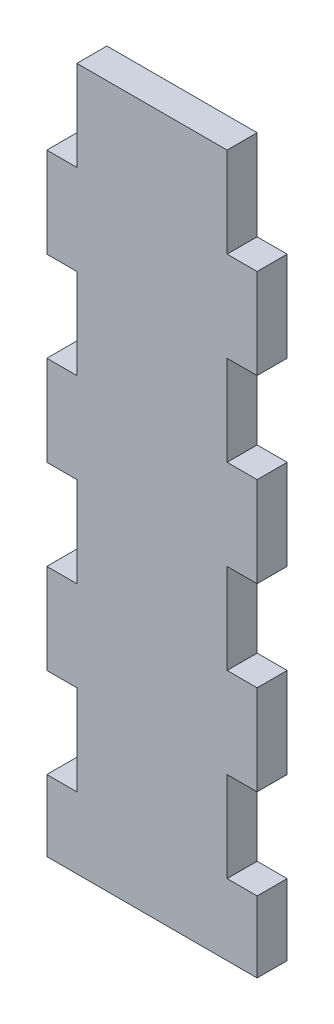
ISO-10303-21;
HEADER;
FILE_DESCRIPTION(('STEP AP214'),'2;1');
FILE_NAME('part.step','',(''),(''),'','','');
FILE_SCHEMA(('AUTOMOTIVE_DESIGN { 1 0 10303 214 1 1 1 1 }'));
ENDSEC;
DATA;
#1=APPLICATION_CONTEXT('core data for automotive mechanical design processes');
#2=APPLICATION_PROTOCOL_DEFINITION('international standard','automotive_design',2000,#1);
#3=PRODUCT_CONTEXT('',#1,'mechanical');
#4=PRODUCT('Part','Part','',(#3));
#5=PRODUCT_RELATED_PRODUCT_CATEGORY('part','',(#4));
#6=PRODUCT_DEFINITION_FORMATION('','',#4);
#7=PRODUCT_DEFINITION_CONTEXT('part definition',#1,'design');
#8=PRODUCT_DEFINITION('design','',#6,#7);
#9=PRODUCT_DEFINITION_SHAPE('','',#8);
#10=(LENGTH_UNIT() NAMED_UNIT(*) SI_UNIT(.MILLI.,.METRE.));
#11=(NAMED_UNIT(*) PLANE_ANGLE_UNIT() SI_UNIT($,.RADIAN.));
#12=(NAMED_UNIT(*) SI_UNIT($,.STERADIAN.) SOLID_ANGLE_UNIT());
#13=UNCERTAINTY_MEASURE_WITH_UNIT(LENGTH_MEASURE(1.E-05),#10,'distance_accuracy_value','');
#14=(GEOMETRIC_REPRESENTATION_CONTEXT(3) GLOBAL_UNCERTAINTY_ASSIGNED_CONTEXT((#13)) GLOBAL_UNIT_ASSIGNED_CONTEXT((#10,
#11,#12)) REPRESENTATION_CONTEXT('',''));
#15=CARTESIAN_POINT('',(0.,0.,0.));
#16=DIRECTION('',(0.,0.,1.));
#17=DIRECTION('',(1.,0.,0.));
#18=AXIS2_PLACEMENT_3D('',#15,#16,#17);
#19=CARTESIAN_POINT('',(22.8840904006907,110.021741477256,6.));
#20=DIRECTION('',(0.,-1.,0.));
#21=DIRECTION('',(0.,0.,-1.));
#22=AXIS2_PLACEMENT_3D('',#19,#20,#21);
#23=PLANE('',#22);
#24=DIRECTION('',(-1.,0.,0.));
#25=VECTOR('',#24,1.);
#26=CARTESIAN_POINT('',(22.8840904006907,110.021741477256,0.));
#27=LINE('',#26,#25);
#28=CARTESIAN_POINT('',(22.8840904006907,110.021741477256,0.));
#29=VERTEX_POINT('',#28);
#30=CARTESIAN_POINT('',(16.8840904006907,110.021741477256,0.));
#31=VERTEX_POINT('',#30);
#32=EDGE_CURVE('E284',#29,#31,#27,.T.);
#33=ORIENTED_EDGE('',*,*,#32,.F.);
#34=DIRECTION('',(0.,0.,-1.));
#35=VECTOR('',#34,1.);
#36=CARTESIAN_POINT('',(22.8840904006907,110.021741477256,6.));
#37=LINE('',#36,#35);
#38=CARTESIAN_POINT('',(22.8840904006907,110.021741477256,6.));
#39=VERTEX_POINT('',#38);
#40=EDGE_CURVE('E11',#39,#29,#37,.T.);
#41=ORIENTED_EDGE('',*,*,#40,.F.);
#42=DIRECTION('',(-1.,0.,0.));
#43=VECTOR('',#42,1.);
#44=CARTESIAN_POINT('',(22.8840904006907,110.021741477256,6.));
#45=LINE('',#44,#43);
#46=CARTESIAN_POINT('',(16.8840904006907,110.021741477256,6.));
#47=VERTEX_POINT('',#46);
#48=EDGE_CURVE('E398',#39,#47,#45,.T.);
#49=ORIENTED_EDGE('',*,*,#48,.T.);
#50=DIRECTION('',(0.,0.,-1.));
#51=VECTOR('',#50,1.);
#52=CARTESIAN_POINT('',(16.8840904006907,110.021741477256,6.));
#53=LINE('',#52,#51);
#54=EDGE_CURVE('E42',#47,#31,#53,.T.);
#55=ORIENTED_EDGE('',*,*,#54,.T.);
#56=EDGE_LOOP('',(#33,#41,#49,#55));
#57=FACE_BOUND('',#56,.T.);
#58=ADVANCED_FACE('F39',(#57),#23,.T.);
#59=CARTESIAN_POINT('',(22.8840904006907,110.021741477256,6.));
#60=DIRECTION('',(1.,0.,0.));
#61=DIRECTION('',(0.,0.,-1.));
#62=AXIS2_PLACEMENT_3D('',#59,#60,#61);
#63=PLANE('',#62);
#64=DIRECTION('',(0.,-1.,0.));
#65=VECTOR('',#64,1.);
#66=CARTESIAN_POINT('',(22.8840904006907,110.021741477256,0.));
#67=LINE('',#66,#65);
#68=CARTESIAN_POINT('',(22.8840904006907,92.0217414772559,0.));
#69=VERTEX_POINT('',#68);
#70=EDGE_CURVE('E396',#29,#69,#67,.T.);
#71=ORIENTED_EDGE('',*,*,#70,.T.);
#72=DIRECTION('',(0.,0.,-1.));
#73=VECTOR('',#72,1.);
#74=CARTESIAN_POINT('',(22.8840904006907,92.0217414772559,6.));
#75=LINE('',#74,#73);
#76=CARTESIAN_POINT('',(22.8840904006907,92.0217414772559,6.));
#77=VERTEX_POINT('',#76);
#78=EDGE_CURVE('E49',#77,#69,#75,.T.);
#79=ORIENTED_EDGE('',*,*,#78,.F.);
#80=DIRECTION('',(0.,-1.,0.));
#81=VECTOR('',#80,1.);
#82=CARTESIAN_POINT('',(22.8840904006907,110.021741477256,6.));
#83=LINE('',#82,#81);
#84=EDGE_CURVE('E277',#39,#77,#83,.T.);
#85=ORIENTED_EDGE('',*,*,#84,.F.);
#86=ORIENTED_EDGE('',*,*,#40,.T.);
#87=EDGE_LOOP('',(#71,#79,#85,#86));
#88=FACE_BOUND('',#87,.T.);
#89=ADVANCED_FACE('F499',(#88),#63,.F.);
#90=CARTESIAN_POINT('',(16.8840904006907,92.0217414772559,6.));
#91=DIRECTION('',(0.,1.,0.));
#92=DIRECTION('',(0.,0.,1.));
#93=AXIS2_PLACEMENT_3D('',#90,#91,#92);
#94=PLANE('',#93);
#95=DIRECTION('',(1.,0.,0.));
#96=VECTOR('',#95,1.);
#97=CARTESIAN_POINT('',(16.8840904006907,92.0217414772559,0.));
#98=LINE('',#97,#96);
#99=CARTESIAN_POINT('',(16.8840904006907,92.0217414772559,0.));
#100=VERTEX_POINT('',#99);
#101=EDGE_CURVE('E261',#100,#69,#98,.T.);
#102=ORIENTED_EDGE('',*,*,#101,.F.);
#103=DIRECTION('',(0.,0.,-1.));
#104=VECTOR('',#103,1.);
#105=CARTESIAN_POINT('',(16.8840904006907,92.0217414772559,6.));
#106=LINE('',#105,#104);
#107=CARTESIAN_POINT('',(16.8840904006907,92.0217414772559,6.));
#108=VERTEX_POINT('',#107);
#109=EDGE_CURVE('E255',#108,#100,#106,.T.);
#110=ORIENTED_EDGE('',*,*,#109,.F.);
#111=DIRECTION('',(1.,0.,0.));
#112=VECTOR('',#111,1.);
#113=CARTESIAN_POINT('',(16.8840904006907,92.0217414772559,6.));
#114=LINE('',#113,#112);
#115=EDGE_CURVE('E259',#108,#77,#114,.T.);
#116=ORIENTED_EDGE('',*,*,#115,.T.);
#117=ORIENTED_EDGE('',*,*,#78,.T.);
#118=EDGE_LOOP('',(#102,#110,#116,#117));
#119=FACE_BOUND('',#118,.T.);
#120=ADVANCED_FACE('F257',(#119),#94,.T.);
#121=CARTESIAN_POINT('',(16.8840904006907,92.0217414772559,6.));
#122=DIRECTION('',(1.,0.,0.));
#123=DIRECTION('',(0.,0.,-1.));
#124=AXIS2_PLACEMENT_3D('',#121,#122,#123);
#125=PLANE('',#124);
#126=DIRECTION('',(0.,-1.,0.));
#127=VECTOR('',#126,1.);
#128=CARTESIAN_POINT('',(16.8840904006907,92.0217414772559,0.));
#129=LINE('',#128,#127);
#130=CARTESIAN_POINT('',(16.8840904006907,74.0217414772559,0.));
#131=VERTEX_POINT('',#130);
#132=EDGE_CURVE('E391',#100,#131,#129,.T.);
#133=ORIENTED_EDGE('',*,*,#132,.T.);
#134=DIRECTION('',(0.,0.,-1.));
#135=VECTOR('',#134,1.);
#136=CARTESIAN_POINT('',(16.8840904006907,74.0217414772559,6.));
#137=LINE('',#136,#135);
#138=CARTESIAN_POINT('',(16.8840904006907,74.0217414772559,6.));
#139=VERTEX_POINT('',#138);
#140=EDGE_CURVE('E266',#139,#131,#137,.T.);
#141=ORIENTED_EDGE('',*,*,#140,.F.);
#142=DIRECTION('',(0.,-1.,0.));
#143=VECTOR('',#142,1.);
#144=CARTESIAN_POINT('',(16.8840904006907,92.0217414772559,6.));
#145=LINE('',#144,#143);
#146=EDGE_CURVE('E269',#108,#139,#145,.T.);
#147=ORIENTED_EDGE('',*,*,#146,.F.);
#148=ORIENTED_EDGE('',*,*,#109,.T.);
#149=EDGE_LOOP('',(#133,#141,#147,#148));
#150=FACE_BOUND('',#149,.T.);
#151=ADVANCED_FACE('F270',(#150),#125,.F.);
#152=CARTESIAN_POINT('',(22.8840904006907,74.0217414772559,6.));
#153=DIRECTION('',(0.,-1.,0.));
#154=DIRECTION('',(0.,0.,-1.));
#155=AXIS2_PLACEMENT_3D('',#152,#153,#154);
#156=PLANE('',#155);
#157=DIRECTION('',(-1.,0.,0.));
#158=VECTOR('',#157,1.);
#159=CARTESIAN_POINT('',(22.8840904006907,74.0217414772559,0.));
#160=LINE('',#159,#158);
#161=CARTESIAN_POINT('',(22.8840904006907,74.0217414772559,0.));
#162=VERTEX_POINT('',#161);
#163=EDGE_CURVE('E387',#162,#131,#160,.T.);
#164=ORIENTED_EDGE('',*,*,#163,.F.);
#165=DIRECTION('',(0.,0.,-1.));
#166=VECTOR('',#165,1.);
#167=CARTESIAN_POINT('',(22.8840904006907,74.0217414772559,6.));
#168=LINE('',#167,#166);
#169=CARTESIAN_POINT('',(22.8840904006907,74.0217414772559,6.));
#170=VERTEX_POINT('',#169);
#171=EDGE_CURVE('E404',#170,#162,#168,.T.);
#172=ORIENTED_EDGE('',*,*,#171,.F.);
#173=DIRECTION('',(-1.,0.,0.));
#174=VECTOR('',#173,1.);
#175=CARTESIAN_POINT('',(22.8840904006907,74.0217414772559,6.));
#176=LINE('',#175,#174);
#177=EDGE_CURVE('E274',#170,#139,#176,.T.);
#178=ORIENTED_EDGE('',*,*,#177,.T.);
#179=ORIENTED_EDGE('',*,*,#140,.T.);
#180=EDGE_LOOP('',(#164,#172,#178,#179));
#181=FACE_BOUND('',#180,.T.);
#182=ADVANCED_FACE('F594',(#181),#156,.T.);
#183=CARTESIAN_POINT('',(22.8840904006907,74.0217414772559,6.));
#184=DIRECTION('',(1.,0.,0.));
#185=DIRECTION('',(0.,0.,-1.));
#186=AXIS2_PLACEMENT_3D('',#183,#184,#185);
#187=PLANE('',#186);
#188=DIRECTION('',(0.,-1.,0.));
#189=VECTOR('',#188,1.);
#190=CARTESIAN_POINT('',(22.8840904006907,74.0217414772559,0.));
#191=LINE('',#190,#189);
#192=CARTESIAN_POINT('',(22.8840904006907,56.0217414772559,0.));
#193=VERTEX_POINT('',#192);
#194=EDGE_CURVE('E383',#162,#193,#191,.T.);
#195=ORIENTED_EDGE('',*,*,#194,.T.);
#196=DIRECTION('',(0.,0.,-1.));
#197=VECTOR('',#196,1.);
#198=CARTESIAN_POINT('',(22.8840904006907,56.0217414772559,6.));
#199=LINE('',#198,#197);
#200=CARTESIAN_POINT('',(22.8840904006907,56.0217414772559,6.));
#201=VERTEX_POINT('',#200);
#202=EDGE_CURVE('E407',#201,#193,#199,.T.);
#203=ORIENTED_EDGE('',*,*,#202,.F.);
#204=DIRECTION('',(0.,-1.,0.));
#205=VECTOR('',#204,1.);
#206=CARTESIAN_POINT('',(22.8840904006907,74.0217414772559,6.));
#207=LINE('',#206,#205);
#208=EDGE_CURVE('E589',#170,#201,#207,.T.);
#209=ORIENTED_EDGE('',*,*,#208,.F.);
#210=ORIENTED_EDGE('',*,*,#171,.T.);
#211=EDGE_LOOP('',(#195,#203,#209,#210));
#212=FACE_BOUND('',#211,.T.);
#213=ADVANCED_FACE('F599',(#212),#187,.F.);
#214=CARTESIAN_POINT('',(16.8840904006907,56.0217414772559,6.));
#215=DIRECTION('',(0.,1.,0.));
#216=DIRECTION('',(0.,0.,1.));
#217=AXIS2_PLACEMENT_3D('',#214,#215,#216);
#218=PLANE('',#217);
#219=DIRECTION('',(1.,0.,0.));
#220=VECTOR('',#219,1.);
#221=CARTESIAN_POINT('',(16.8840904006907,56.0217414772559,0.));
#222=LINE('',#221,#220);
#223=CARTESIAN_POINT('',(16.8840904006907,56.0217414772559,0.));
#224=VERTEX_POINT('',#223);
#225=EDGE_CURVE('E379',#224,#193,#222,.T.);
#226=ORIENTED_EDGE('',*,*,#225,.F.);
#227=DIRECTION('',(0.,0.,-1.));
#228=VECTOR('',#227,1.);
#229=CARTESIAN_POINT('',(16.8840904006907,56.0217414772559,6.));
#230=LINE('',#229,#228);
#231=CARTESIAN_POINT('',(16.8840904006907,56.0217414772559,6.));
#232=VERTEX_POINT('',#231);
#233=EDGE_CURVE('E410',#232,#224,#230,.T.);
#234=ORIENTED_EDGE('',*,*,#233,.F.);
#235=DIRECTION('',(1.,0.,0.));
#236=VECTOR('',#235,1.);
#237=CARTESIAN_POINT('',(16.8840904006907,56.0217414772559,6.));
#238=LINE('',#237,#236);
#239=EDGE_CURVE('E585',#232,#201,#238,.T.);
#240=ORIENTED_EDGE('',*,*,#239,.T.);
#241=ORIENTED_EDGE('',*,*,#202,.T.);
#242=EDGE_LOOP('',(#226,#234,#240,#241));
#243=FACE_BOUND('',#242,.T.);
#244=ADVANCED_FACE('F603',(#243),#218,.T.);
#245=CARTESIAN_POINT('',(16.8840904006907,56.0217414772559,6.));
#246=DIRECTION('',(1.,0.,0.));
#247=DIRECTION('',(0.,0.,-1.));
#248=AXIS2_PLACEMENT_3D('',#245,#246,#247);
#249=PLANE('',#248);
#250=DIRECTION('',(0.,-1.,0.));
#251=VECTOR('',#250,1.);
#252=CARTESIAN_POINT('',(16.8840904006907,56.0217414772559,0.));
#253=LINE('',#252,#251);
#254=CARTESIAN_POINT('',(16.8840904006907,38.0217414772559,0.));
#255=VERTEX_POINT('',#254);
#256=EDGE_CURVE('E375',#224,#255,#253,.T.);
#257=ORIENTED_EDGE('',*,*,#256,.T.);
#258=DIRECTION('',(0.,0.,-1.));
#259=VECTOR('',#258,1.);
#260=CARTESIAN_POINT('',(16.8840904006907,38.0217414772559,6.));
#261=LINE('',#260,#259);
#262=CARTESIAN_POINT('',(16.8840904006907,38.0217414772559,6.));
#263=VERTEX_POINT('',#262);
#264=EDGE_CURVE('E413',#263,#255,#261,.T.);
#265=ORIENTED_EDGE('',*,*,#264,.F.);
#266=DIRECTION('',(0.,-1.,0.));
#267=VECTOR('',#266,1.);
#268=CARTESIAN_POINT('',(16.8840904006907,56.0217414772559,6.));
#269=LINE('',#268,#267);
#270=EDGE_CURVE('E582',#232,#263,#269,.T.);
#271=ORIENTED_EDGE('',*,*,#270,.F.);
#272=ORIENTED_EDGE('',*,*,#233,.T.);
#273=EDGE_LOOP('',(#257,#265,#271,#272));
#274=FACE_BOUND('',#273,.T.);
#275=ADVANCED_FACE('F608',(#274),#249,.F.);
#276=CARTESIAN_POINT('',(22.8840904006907,38.0217414772559,6.));
#277=DIRECTION('',(0.,-1.,0.));
#278=DIRECTION('',(0.,0.,-1.));
#279=AXIS2_PLACEMENT_3D('',#276,#277,#278);
#280=PLANE('',#279);
#281=DIRECTION('',(-1.,0.,0.));
#282=VECTOR('',#281,1.);
#283=CARTESIAN_POINT('',(22.8840904006907,38.0217414772559,0.));
#284=LINE('',#283,#282);
#285=CARTESIAN_POINT('',(22.8840904006907,38.0217414772559,0.));
#286=VERTEX_POINT('',#285);
#287=EDGE_CURVE('E371',#286,#255,#284,.T.);
#288=ORIENTED_EDGE('',*,*,#287,.F.);
#289=DIRECTION('',(0.,0.,-1.));
#290=VECTOR('',#289,1.);
#291=CARTESIAN_POINT('',(22.8840904006907,38.0217414772559,6.));
#292=LINE('',#291,#290);
#293=CARTESIAN_POINT('',(22.8840904006907,38.0217414772559,6.));
#294=VERTEX_POINT('',#293);
#295=EDGE_CURVE('E416',#294,#286,#292,.T.);
#296=ORIENTED_EDGE('',*,*,#295,.F.);
#297=DIRECTION('',(-1.,0.,0.));
#298=VECTOR('',#297,1.);
#299=CARTESIAN_POINT('',(22.8840904006907,38.0217414772559,6.));
#300=LINE('',#299,#298);
#301=EDGE_CURVE('E578',#294,#263,#300,.T.);
#302=ORIENTED_EDGE('',*,*,#301,.T.);
#303=ORIENTED_EDGE('',*,*,#264,.T.);
#304=EDGE_LOOP('',(#288,#296,#302,#303));
#305=FACE_BOUND('',#304,.T.);
#306=ADVANCED_FACE('F614',(#305),#280,.T.);
#307=CARTESIAN_POINT('',(22.8840904006907,38.0217414772559,6.));
#308=DIRECTION('',(1.,0.,0.));
#309=DIRECTION('',(0.,0.,-1.));
#310=AXIS2_PLACEMENT_3D('',#307,#308,#309);
#311=PLANE('',#310);
#312=DIRECTION('',(0.,-1.,0.));
#313=VECTOR('',#312,1.);
#314=CARTESIAN_POINT('',(22.8840904006907,38.0217414772559,0.));
#315=LINE('',#314,#313);
#316=CARTESIAN_POINT('',(22.8840904006907,20.0217414772559,0.));
#317=VERTEX_POINT('',#316);
#318=EDGE_CURVE('E368',#286,#317,#315,.T.);
#319=ORIENTED_EDGE('',*,*,#318,.T.);
#320=DIRECTION('',(0.,0.,-1.));
#321=VECTOR('',#320,1.);
#322=CARTESIAN_POINT('',(22.8840904006907,20.0217414772559,6.));
#323=LINE('',#322,#321);
#324=CARTESIAN_POINT('',(22.8840904006907,20.0217414772559,6.));
#325=VERTEX_POINT('',#324);
#326=EDGE_CURVE('E419',#325,#317,#323,.T.);
#327=ORIENTED_EDGE('',*,*,#326,.F.);
#328=DIRECTION('',(0.,-1.,0.));
#329=VECTOR('',#328,1.);
#330=CARTESIAN_POINT('',(22.8840904006907,38.0217414772559,6.));
#331=LINE('',#330,#329);
#332=EDGE_CURVE('E575',#294,#325,#331,.T.);
#333=ORIENTED_EDGE('',*,*,#332,.F.);
#334=ORIENTED_EDGE('',*,*,#295,.T.);
#335=EDGE_LOOP('',(#319,#327,#333,#334));
#336=FACE_BOUND('',#335,.T.);
#337=ADVANCED_FACE('F617',(#336),#311,.F.);
#338=CARTESIAN_POINT('',(22.8840904006907,20.0217414772559,6.));
#339=DIRECTION('',(0.,-1.,0.));
#340=DIRECTION('',(0.,0.,-1.));
#341=AXIS2_PLACEMENT_3D('',#338,#339,#340);
#342=PLANE('',#341);
#343=DIRECTION('',(-1.,0.,0.));
#344=VECTOR('',#343,1.);
#345=CARTESIAN_POINT('',(22.8840904006907,20.0217414772559,0.));
#346=LINE('',#345,#344);
#347=CARTESIAN_POINT('',(16.8840904006907,20.0217414772559,0.));
#348=VERTEX_POINT('',#347);
#349=EDGE_CURVE('E365',#317,#348,#346,.T.);
#350=ORIENTED_EDGE('',*,*,#349,.T.);
#351=DIRECTION('',(0.,0.,-1.));
#352=VECTOR('',#351,1.);
#353=CARTESIAN_POINT('',(16.8840904006907,20.0217414772559,6.));
#354=LINE('',#353,#352);
#355=CARTESIAN_POINT('',(16.8840904006907,20.0217414772559,6.));
#356=VERTEX_POINT('',#355);
#357=EDGE_CURVE('E423',#356,#348,#354,.T.);
#358=ORIENTED_EDGE('',*,*,#357,.F.);
#359=DIRECTION('',(-1.,0.,0.));
#360=VECTOR('',#359,1.);
#361=CARTESIAN_POINT('',(22.8840904006907,20.0217414772559,6.));
#362=LINE('',#361,#360);
#363=EDGE_CURVE('E572',#325,#356,#362,.T.);
#364=ORIENTED_EDGE('',*,*,#363,.F.);
#365=ORIENTED_EDGE('',*,*,#326,.T.);
#366=EDGE_LOOP('',(#350,#358,#364,#365));
#367=FACE_BOUND('',#366,.T.);
#368=ADVANCED_FACE('F622',(#367),#342,.F.);
#369=CARTESIAN_POINT('',(16.8840904006907,20.0217414772559,6.));
#370=DIRECTION('',(1.,0.,0.));
#371=DIRECTION('',(0.,1.,0.));
#372=AXIS2_PLACEMENT_3D('',#369,#370,#371);
#373=PLANE('',#372);
#374=DIRECTION('',(0.,-1.,0.));
#375=VECTOR('',#374,1.);
#376=CARTESIAN_POINT('',(16.8840904006907,20.0217414772559,0.));
#377=LINE('',#376,#375);
#378=CARTESIAN_POINT('',(16.8840904006912,5.82936261258773,0.));
#379=VERTEX_POINT('',#378);
#380=EDGE_CURVE('E362',#348,#379,#377,.T.);
#381=ORIENTED_EDGE('',*,*,#380,.T.);
#382=DIRECTION('',(0.,0.,-1.));
#383=VECTOR('',#382,1.);
#384=CARTESIAN_POINT('',(16.8840904006912,5.82936261258773,6.));
#385=LINE('',#384,#383);
#386=CARTESIAN_POINT('',(16.8840904006912,5.82936261258773,6.));
#387=VERTEX_POINT('',#386);
#388=EDGE_CURVE('E427',#387,#379,#385,.T.);
#389=ORIENTED_EDGE('',*,*,#388,.F.);
#390=DIRECTION('',(0.,-1.,0.));
#391=VECTOR('',#390,1.);
#392=CARTESIAN_POINT('',(16.8840904006907,20.0217414772559,6.));
#393=LINE('',#392,#391);
#394=EDGE_CURVE('E569',#356,#387,#393,.T.);
#395=ORIENTED_EDGE('',*,*,#394,.F.);
#396=ORIENTED_EDGE('',*,*,#357,.T.);
#397=EDGE_LOOP('',(#381,#389,#395,#396));
#398=FACE_BOUND('',#397,.T.);
#399=ADVANCED_FACE('F629',(#398),#373,.F.);
#400=CARTESIAN_POINT('',(16.8840904006912,5.82936261258773,6.));
#401=DIRECTION('',(0.,1.,0.));
#402=DIRECTION('',(0.,0.,1.));
#403=AXIS2_PLACEMENT_3D('',#400,#401,#402);
#404=PLANE('',#403);
#405=DIRECTION('',(1.,0.,0.));
#406=VECTOR('',#405,1.);
#407=CARTESIAN_POINT('',(16.8840904006912,5.82936261258773,0.));
#408=LINE('',#407,#406);
#409=CARTESIAN_POINT('',(58.8840904006907,5.82936261258773,0.));
#410=VERTEX_POINT('',#409);
#411=EDGE_CURVE('E358',#379,#410,#408,.T.);
#412=ORIENTED_EDGE('',*,*,#411,.T.);
#413=DIRECTION('',(0.,0.,-1.));
#414=VECTOR('',#413,1.);
#415=CARTESIAN_POINT('',(58.8840904006907,5.82936261258773,6.));
#416=LINE('',#415,#414);
#417=CARTESIAN_POINT('',(58.8840904006907,5.82936261258773,6.));
#418=VERTEX_POINT('',#417);
#419=EDGE_CURVE('E431',#418,#410,#416,.T.);
#420=ORIENTED_EDGE('',*,*,#419,.F.);
#421=DIRECTION('',(1.,0.,0.));
#422=VECTOR('',#421,1.);
#423=CARTESIAN_POINT('',(16.8840904006912,5.82936261258773,6.));
#424=LINE('',#423,#422);
#425=EDGE_CURVE('E566',#387,#418,#424,.T.);
#426=ORIENTED_EDGE('',*,*,#425,.F.);
#427=ORIENTED_EDGE('',*,*,#388,.T.);
#428=EDGE_LOOP('',(#412,#420,#426,#427));
#429=FACE_BOUND('',#428,.T.);
#430=ADVANCED_FACE('F633',(#429),#404,.F.);
#431=CARTESIAN_POINT('',(58.8840904006907,20.0217414772559,6.));
#432=DIRECTION('',(1.,0.,0.));
#433=DIRECTION('',(0.,0.,-1.));
#434=AXIS2_PLACEMENT_3D('',#431,#432,#433);
#435=PLANE('',#434);
#436=DIRECTION('',(0.,-1.,0.));
#437=VECTOR('',#436,1.);
#438=CARTESIAN_POINT('',(58.8840904006907,20.0217414772559,0.));
#439=LINE('',#438,#437);
#440=CARTESIAN_POINT('',(58.8840904006907,20.0217414772559,0.));
#441=VERTEX_POINT('',#440);
#442=EDGE_CURVE('E354',#441,#410,#439,.T.);
#443=ORIENTED_EDGE('',*,*,#442,.F.);
#444=DIRECTION('',(0.,0.,-1.));
#445=VECTOR('',#444,1.);
#446=CARTESIAN_POINT('',(58.8840904006907,20.0217414772559,6.));
#447=LINE('',#446,#445);
#448=CARTESIAN_POINT('',(58.8840904006907,20.0217414772559,6.));
#449=VERTEX_POINT('',#448);
#450=EDGE_CURVE('E434',#449,#441,#447,.T.);
#451=ORIENTED_EDGE('',*,*,#450,.F.);
#452=DIRECTION('',(0.,-1.,0.));
#453=VECTOR('',#452,1.);
#454=CARTESIAN_POINT('',(58.8840904006907,20.0217414772559,6.));
#455=LINE('',#454,#453);
#456=EDGE_CURVE('E562',#449,#418,#455,.T.);
#457=ORIENTED_EDGE('',*,*,#456,.T.);
#458=ORIENTED_EDGE('',*,*,#419,.T.);
#459=EDGE_LOOP('',(#443,#451,#457,#458));
#460=FACE_BOUND('',#459,.T.);
#461=ADVANCED_FACE('F636',(#460),#435,.T.);
#462=CARTESIAN_POINT('',(52.8840904006907,20.0217414772559,6.));
#463=DIRECTION('',(0.,1.,0.));
#464=DIRECTION('',(0.,0.,1.));
#465=AXIS2_PLACEMENT_3D('',#462,#463,#464);
#466=PLANE('',#465);
#467=DIRECTION('',(1.,0.,0.));
#468=VECTOR('',#467,1.);
#469=CARTESIAN_POINT('',(52.8840904006907,20.0217414772559,0.));
#470=LINE('',#469,#468);
#471=CARTESIAN_POINT('',(52.8840904006907,20.0217414772559,0.));
#472=VERTEX_POINT('',#471);
#473=EDGE_CURVE('E350',#472,#441,#470,.T.);
#474=ORIENTED_EDGE('',*,*,#473,.F.);
#475=DIRECTION('',(0.,0.,-1.));
#476=VECTOR('',#475,1.);
#477=CARTESIAN_POINT('',(52.8840904006907,20.0217414772559,6.));
#478=LINE('',#477,#476);
#479=CARTESIAN_POINT('',(52.8840904006907,20.0217414772559,6.));
#480=VERTEX_POINT('',#479);
#481=EDGE_CURVE('E437',#480,#472,#478,.T.);
#482=ORIENTED_EDGE('',*,*,#481,.F.);
#483=DIRECTION('',(1.,0.,0.));
#484=VECTOR('',#483,1.);
#485=CARTESIAN_POINT('',(52.8840904006907,20.0217414772559,6.));
#486=LINE('',#485,#484);
#487=EDGE_CURVE('E558',#480,#449,#486,.T.);
#488=ORIENTED_EDGE('',*,*,#487,.T.);
#489=ORIENTED_EDGE('',*,*,#450,.T.);
#490=EDGE_LOOP('',(#474,#482,#488,#489));
#491=FACE_BOUND('',#490,.T.);
#492=ADVANCED_FACE('F640',(#491),#466,.T.);
#493=CARTESIAN_POINT('',(52.8840904006907,20.0217414772559,6.));
#494=DIRECTION('',(-1.,0.,0.));
#495=DIRECTION('',(0.,0.,1.));
#496=AXIS2_PLACEMENT_3D('',#493,#494,#495);
#497=PLANE('',#496);
#498=DIRECTION('',(0.,1.,0.));
#499=VECTOR('',#498,1.);
#500=CARTESIAN_POINT('',(52.8840904006907,20.0217414772559,0.));
#501=LINE('',#500,#499);
#502=CARTESIAN_POINT('',(52.8840904006907,38.0217414772559,0.));
#503=VERTEX_POINT('',#502);
#504=EDGE_CURVE('E347',#472,#503,#501,.T.);
#505=ORIENTED_EDGE('',*,*,#504,.T.);
#506=DIRECTION('',(0.,0.,-1.));
#507=VECTOR('',#506,1.);
#508=CARTESIAN_POINT('',(52.8840904006907,38.0217414772559,6.));
#509=LINE('',#508,#507);
#510=CARTESIAN_POINT('',(52.8840904006907,38.0217414772559,6.));
#511=VERTEX_POINT('',#510);
#512=EDGE_CURVE('E440',#511,#503,#509,.T.);
#513=ORIENTED_EDGE('',*,*,#512,.F.);
#514=DIRECTION('',(0.,1.,0.));
#515=VECTOR('',#514,1.);
#516=CARTESIAN_POINT('',(52.8840904006907,20.0217414772559,6.));
#517=LINE('',#516,#515);
#518=EDGE_CURVE('E555',#480,#511,#517,.T.);
#519=ORIENTED_EDGE('',*,*,#518,.F.);
#520=ORIENTED_EDGE('',*,*,#481,.T.);
#521=EDGE_LOOP('',(#505,#513,#519,#520));
#522=FACE_BOUND('',#521,.T.);
#523=ADVANCED_FACE('F645',(#522),#497,.F.);
#524=CARTESIAN_POINT('',(52.8840904006907,38.0217414772559,6.));
#525=DIRECTION('',(0.,1.,0.));
#526=DIRECTION('',(0.,0.,1.));
#527=AXIS2_PLACEMENT_3D('',#524,#525,#526);
#528=PLANE('',#527);
#529=DIRECTION('',(1.,0.,0.));
#530=VECTOR('',#529,1.);
#531=CARTESIAN_POINT('',(52.8840904006907,38.0217414772559,0.));
#532=LINE('',#531,#530);
#533=CARTESIAN_POINT('',(58.8840904006907,38.0217414772559,0.));
#534=VERTEX_POINT('',#533);
#535=EDGE_CURVE('E343',#503,#534,#532,.T.);
#536=ORIENTED_EDGE('',*,*,#535,.T.);
#537=DIRECTION('',(0.,0.,-1.));
#538=VECTOR('',#537,1.);
#539=CARTESIAN_POINT('',(58.8840904006907,38.0217414772559,6.));
#540=LINE('',#539,#538);
#541=CARTESIAN_POINT('',(58.8840904006907,38.0217414772559,6.));
#542=VERTEX_POINT('',#541);
#543=EDGE_CURVE('E444',#542,#534,#540,.T.);
#544=ORIENTED_EDGE('',*,*,#543,.F.);
#545=DIRECTION('',(1.,0.,0.));
#546=VECTOR('',#545,1.);
#547=CARTESIAN_POINT('',(52.8840904006907,38.0217414772559,6.));
#548=LINE('',#547,#546);
#549=EDGE_CURVE('E552',#511,#542,#548,.T.);
#550=ORIENTED_EDGE('',*,*,#549,.F.);
#551=ORIENTED_EDGE('',*,*,#512,.T.);
#552=EDGE_LOOP('',(#536,#544,#550,#551));
#553=FACE_BOUND('',#552,.T.);
#554=ADVANCED_FACE('F650',(#553),#528,.F.);
#555=CARTESIAN_POINT('',(58.8840904006907,56.0217414772559,6.));
#556=DIRECTION('',(1.,0.,0.));
#557=DIRECTION('',(0.,0.,-1.));
#558=AXIS2_PLACEMENT_3D('',#555,#556,#557);
#559=PLANE('',#558);
#560=DIRECTION('',(0.,-1.,0.));
#561=VECTOR('',#560,1.);
#562=CARTESIAN_POINT('',(58.8840904006907,56.0217414772559,0.));
#563=LINE('',#562,#561);
#564=CARTESIAN_POINT('',(58.8840904006907,56.0217414772559,0.));
#565=VERTEX_POINT('',#564);
#566=EDGE_CURVE('E339',#565,#534,#563,.T.);
#567=ORIENTED_EDGE('',*,*,#566,.F.);
#568=DIRECTION('',(0.,0.,-1.));
#569=VECTOR('',#568,1.);
#570=CARTESIAN_POINT('',(58.8840904006907,56.0217414772559,6.));
#571=LINE('',#570,#569);
#572=CARTESIAN_POINT('',(58.8840904006907,56.0217414772559,6.));
#573=VERTEX_POINT('',#572);
#574=EDGE_CURVE('E447',#573,#565,#571,.T.);
#575=ORIENTED_EDGE('',*,*,#574,.F.);
#576=DIRECTION('',(0.,-1.,0.));
#577=VECTOR('',#576,1.);
#578=CARTESIAN_POINT('',(58.8840904006907,56.0217414772559,6.));
#579=LINE('',#578,#577);
#580=EDGE_CURVE('E548',#573,#542,#579,.T.);
#581=ORIENTED_EDGE('',*,*,#580,.T.);
#582=ORIENTED_EDGE('',*,*,#543,.T.);
#583=EDGE_LOOP('',(#567,#575,#581,#582));
#584=FACE_BOUND('',#583,.T.);
#585=ADVANCED_FACE('F654',(#584),#559,.T.);
#586=CARTESIAN_POINT('',(58.8840904006907,56.0217414772559,6.));
#587=DIRECTION('',(0.,-1.,0.));
#588=DIRECTION('',(0.,0.,-1.));
#589=AXIS2_PLACEMENT_3D('',#586,#587,#588);
#590=PLANE('',#589);
#591=DIRECTION('',(-1.,0.,0.));
#592=VECTOR('',#591,1.);
#593=CARTESIAN_POINT('',(58.8840904006907,56.0217414772559,0.));
#594=LINE('',#593,#592);
#595=CARTESIAN_POINT('',(52.8840904006907,56.0217414772559,0.));
#596=VERTEX_POINT('',#595);
#597=EDGE_CURVE('E336',#565,#596,#594,.T.);
#598=ORIENTED_EDGE('',*,*,#597,.T.);
#599=DIRECTION('',(0.,0.,-1.));
#600=VECTOR('',#599,1.);
#601=CARTESIAN_POINT('',(52.8840904006907,56.0217414772559,6.));
#602=LINE('',#601,#600);
#603=CARTESIAN_POINT('',(52.8840904006907,56.0217414772559,6.));
#604=VERTEX_POINT('',#603);
#605=EDGE_CURVE('E450',#604,#596,#602,.T.);
#606=ORIENTED_EDGE('',*,*,#605,.F.);
#607=DIRECTION('',(-1.,0.,0.));
#608=VECTOR('',#607,1.);
#609=CARTESIAN_POINT('',(58.8840904006907,56.0217414772559,6.));
#610=LINE('',#609,#608);
#611=EDGE_CURVE('E545',#573,#604,#610,.T.);
#612=ORIENTED_EDGE('',*,*,#611,.F.);
#613=ORIENTED_EDGE('',*,*,#574,.T.);
#614=EDGE_LOOP('',(#598,#606,#612,#613));
#615=FACE_BOUND('',#614,.T.);
#616=ADVANCED_FACE('F659',(#615),#590,.F.);
#617=CARTESIAN_POINT('',(52.8840904006907,56.0217414772559,6.));
#618=DIRECTION('',(-1.,0.,0.));
#619=DIRECTION('',(0.,0.,1.));
#620=AXIS2_PLACEMENT_3D('',#617,#618,#619);
#621=PLANE('',#620);
#622=DIRECTION('',(0.,1.,0.));
#623=VECTOR('',#622,1.);
#624=CARTESIAN_POINT('',(52.8840904006907,56.0217414772559,0.));
#625=LINE('',#624,#623);
#626=CARTESIAN_POINT('',(52.8840904006907,74.0217414772559,0.));
#627=VERTEX_POINT('',#626);
#628=EDGE_CURVE('E333',#596,#627,#625,.T.);
#629=ORIENTED_EDGE('',*,*,#628,.T.);
#630=DIRECTION('',(0.,0.,-1.));
#631=VECTOR('',#630,1.);
#632=CARTESIAN_POINT('',(52.8840904006907,74.0217414772559,6.));
#633=LINE('',#632,#631);
#634=CARTESIAN_POINT('',(52.8840904006907,74.0217414772559,6.));
#635=VERTEX_POINT('',#634);
#636=EDGE_CURVE('E454',#635,#627,#633,.T.);
#637=ORIENTED_EDGE('',*,*,#636,.F.);
#638=DIRECTION('',(0.,1.,0.));
#639=VECTOR('',#638,1.);
#640=CARTESIAN_POINT('',(52.8840904006907,56.0217414772559,6.));
#641=LINE('',#640,#639);
#642=EDGE_CURVE('E542',#604,#635,#641,.T.);
#643=ORIENTED_EDGE('',*,*,#642,.F.);
#644=ORIENTED_EDGE('',*,*,#605,.T.);
#645=EDGE_LOOP('',(#629,#637,#643,#644));
#646=FACE_BOUND('',#645,.T.);
#647=ADVANCED_FACE('F666',(#646),#621,.F.);
#648=CARTESIAN_POINT('',(52.8840904006907,74.0217414772559,6.));
#649=DIRECTION('',(0.,1.,0.));
#650=DIRECTION('',(0.,0.,1.));
#651=AXIS2_PLACEMENT_3D('',#648,#649,#650);
#652=PLANE('',#651);
#653=DIRECTION('',(1.,0.,0.));
#654=VECTOR('',#653,1.);
#655=CARTESIAN_POINT('',(52.8840904006907,74.0217414772559,0.));
#656=LINE('',#655,#654);
#657=CARTESIAN_POINT('',(58.8840904006907,74.0217414772559,0.));
#658=VERTEX_POINT('',#657);
#659=EDGE_CURVE('E329',#627,#658,#656,.T.);
#660=ORIENTED_EDGE('',*,*,#659,.T.);
#661=DIRECTION('',(0.,0.,-1.));
#662=VECTOR('',#661,1.);
#663=CARTESIAN_POINT('',(58.8840904006907,74.0217414772559,6.));
#664=LINE('',#663,#662);
#665=CARTESIAN_POINT('',(58.8840904006907,74.0217414772559,6.));
#666=VERTEX_POINT('',#665);
#667=EDGE_CURVE('E458',#666,#658,#664,.T.);
#668=ORIENTED_EDGE('',*,*,#667,.F.);
#669=DIRECTION('',(1.,0.,0.));
#670=VECTOR('',#669,1.);
#671=CARTESIAN_POINT('',(52.8840904006907,74.0217414772559,6.));
#672=LINE('',#671,#670);
#673=EDGE_CURVE('E539',#635,#666,#672,.T.);
#674=ORIENTED_EDGE('',*,*,#673,.F.);
#675=ORIENTED_EDGE('',*,*,#636,.T.);
#676=EDGE_LOOP('',(#660,#668,#674,#675));
#677=FACE_BOUND('',#676,.T.);
#678=ADVANCED_FACE('F670',(#677),#652,.F.);
#679=CARTESIAN_POINT('',(58.8840904006907,92.0217414772559,6.));
#680=DIRECTION('',(1.,0.,0.));
#681=DIRECTION('',(0.,0.,-1.));
#682=AXIS2_PLACEMENT_3D('',#679,#680,#681);
#683=PLANE('',#682);
#684=DIRECTION('',(0.,-1.,0.));
#685=VECTOR('',#684,1.);
#686=CARTESIAN_POINT('',(58.8840904006907,92.0217414772559,0.));
#687=LINE('',#686,#685);
#688=CARTESIAN_POINT('',(58.8840904006907,92.0217414772559,0.));
#689=VERTEX_POINT('',#688);
#690=EDGE_CURVE('E325',#689,#658,#687,.T.);
#691=ORIENTED_EDGE('',*,*,#690,.F.);
#692=DIRECTION('',(0.,0.,-1.));
#693=VECTOR('',#692,1.);
#694=CARTESIAN_POINT('',(58.8840904006907,92.0217414772559,6.));
#695=LINE('',#694,#693);
#696=CARTESIAN_POINT('',(58.8840904006907,92.0217414772559,6.));
#697=VERTEX_POINT('',#696);
#698=EDGE_CURVE('E461',#697,#689,#695,.T.);
#699=ORIENTED_EDGE('',*,*,#698,.F.);
#700=DIRECTION('',(0.,-1.,0.));
#701=VECTOR('',#700,1.);
#702=CARTESIAN_POINT('',(58.8840904006907,92.0217414772559,6.));
#703=LINE('',#702,#701);
#704=EDGE_CURVE('E535',#697,#666,#703,.T.);
#705=ORIENTED_EDGE('',*,*,#704,.T.);
#706=ORIENTED_EDGE('',*,*,#667,.T.);
#707=EDGE_LOOP('',(#691,#699,#705,#706));
#708=FACE_BOUND('',#707,.T.);
#709=ADVANCED_FACE('F673',(#708),#683,.T.);
#710=CARTESIAN_POINT('',(58.8840904006907,92.0217414772559,6.));
#711=DIRECTION('',(0.,-1.,0.));
#712=DIRECTION('',(0.,0.,-1.));
#713=AXIS2_PLACEMENT_3D('',#710,#711,#712);
#714=PLANE('',#713);
#715=DIRECTION('',(-1.,0.,0.));
#716=VECTOR('',#715,1.);
#717=CARTESIAN_POINT('',(58.8840904006907,92.0217414772559,0.));
#718=LINE('',#717,#716);
#719=CARTESIAN_POINT('',(52.8840904006907,92.0217414772559,0.));
#720=VERTEX_POINT('',#719);
#721=EDGE_CURVE('E322',#689,#720,#718,.T.);
#722=ORIENTED_EDGE('',*,*,#721,.T.);
#723=DIRECTION('',(0.,0.,-1.));
#724=VECTOR('',#723,1.);
#725=CARTESIAN_POINT('',(52.8840904006907,92.0217414772559,6.));
#726=LINE('',#725,#724);
#727=CARTESIAN_POINT('',(52.8840904006907,92.0217414772559,6.));
#728=VERTEX_POINT('',#727);
#729=EDGE_CURVE('E464',#728,#720,#726,.T.);
#730=ORIENTED_EDGE('',*,*,#729,.F.);
#731=DIRECTION('',(-1.,0.,0.));
#732=VECTOR('',#731,1.);
#733=CARTESIAN_POINT('',(58.8840904006907,92.0217414772559,6.));
#734=LINE('',#733,#732);
#735=EDGE_CURVE('E532',#697,#728,#734,.T.);
#736=ORIENTED_EDGE('',*,*,#735,.F.);
#737=ORIENTED_EDGE('',*,*,#698,.T.);
#738=EDGE_LOOP('',(#722,#730,#736,#737));
#739=FACE_BOUND('',#738,.T.);
#740=ADVANCED_FACE('F679',(#739),#714,.F.);
#741=CARTESIAN_POINT('',(52.8840904006907,92.0217414772559,6.));
#742=DIRECTION('',(-1.,0.,0.));
#743=DIRECTION('',(0.,0.,1.));
#744=AXIS2_PLACEMENT_3D('',#741,#742,#743);
#745=PLANE('',#744);
#746=DIRECTION('',(0.,1.,0.));
#747=VECTOR('',#746,1.);
#748=CARTESIAN_POINT('',(52.8840904006907,92.0217414772559,0.));
#749=LINE('',#748,#747);
#750=CARTESIAN_POINT('',(52.8840904006907,110.021741477256,0.));
#751=VERTEX_POINT('',#750);
#752=EDGE_CURVE('E319',#720,#751,#749,.T.);
#753=ORIENTED_EDGE('',*,*,#752,.T.);
#754=DIRECTION('',(0.,0.,-1.));
#755=VECTOR('',#754,1.);
#756=CARTESIAN_POINT('',(52.8840904006907,110.021741477256,6.));
#757=LINE('',#756,#755);
#758=CARTESIAN_POINT('',(52.8840904006907,110.021741477256,6.));
#759=VERTEX_POINT('',#758);
#760=EDGE_CURVE('E468',#759,#751,#757,.T.);
#761=ORIENTED_EDGE('',*,*,#760,.F.);
#762=DIRECTION('',(0.,1.,0.));
#763=VECTOR('',#762,1.);
#764=CARTESIAN_POINT('',(52.8840904006907,92.0217414772559,6.));
#765=LINE('',#764,#763);
#766=EDGE_CURVE('E529',#728,#759,#765,.T.);
#767=ORIENTED_EDGE('',*,*,#766,.F.);
#768=ORIENTED_EDGE('',*,*,#729,.T.);
#769=EDGE_LOOP('',(#753,#761,#767,#768));
#770=FACE_BOUND('',#769,.T.);
#771=ADVANCED_FACE('F683',(#770),#745,.F.);
#772=CARTESIAN_POINT('',(52.8840904006907,110.021741477256,6.));
#773=DIRECTION('',(0.,1.,0.));
#774=DIRECTION('',(0.,0.,1.));
#775=AXIS2_PLACEMENT_3D('',#772,#773,#774);
#776=PLANE('',#775);
#777=DIRECTION('',(1.,0.,0.));
#778=VECTOR('',#777,1.);
#779=CARTESIAN_POINT('',(52.8840904006907,110.021741477256,0.));
#780=LINE('',#779,#778);
#781=CARTESIAN_POINT('',(58.8840904006907,110.021741477256,0.));
#782=VERTEX_POINT('',#781);
#783=EDGE_CURVE('E315',#751,#782,#780,.T.);
#784=ORIENTED_EDGE('',*,*,#783,.T.);
#785=DIRECTION('',(0.,0.,-1.));
#786=VECTOR('',#785,1.);
#787=CARTESIAN_POINT('',(58.8840904006907,110.021741477256,6.));
#788=LINE('',#787,#786);
#789=CARTESIAN_POINT('',(58.8840904006907,110.021741477256,6.));
#790=VERTEX_POINT('',#789);
#791=EDGE_CURVE('E472',#790,#782,#788,.T.);
#792=ORIENTED_EDGE('',*,*,#791,.F.);
#793=DIRECTION('',(1.,0.,0.));
#794=VECTOR('',#793,1.);
#795=CARTESIAN_POINT('',(52.8840904006907,110.021741477256,6.));
#796=LINE('',#795,#794);
#797=EDGE_CURVE('E526',#759,#790,#796,.T.);
#798=ORIENTED_EDGE('',*,*,#797,.F.);
#799=ORIENTED_EDGE('',*,*,#760,.T.);
#800=EDGE_LOOP('',(#784,#792,#798,#799));
#801=FACE_BOUND('',#800,.T.);
#802=ADVANCED_FACE('F688',(#801),#776,.F.);
#803=CARTESIAN_POINT('',(58.8840904006907,128.021741477256,6.));
#804=DIRECTION('',(1.,0.,0.));
#805=DIRECTION('',(0.,0.,-1.));
#806=AXIS2_PLACEMENT_3D('',#803,#804,#805);
#807=PLANE('',#806);
#808=DIRECTION('',(0.,-1.,0.));
#809=VECTOR('',#808,1.);
#810=CARTESIAN_POINT('',(58.8840904006907,128.021741477256,0.));
#811=LINE('',#810,#809);
#812=CARTESIAN_POINT('',(58.8840904006907,128.021741477256,0.));
#813=VERTEX_POINT('',#812);
#814=EDGE_CURVE('E311',#813,#782,#811,.T.);
#815=ORIENTED_EDGE('',*,*,#814,.F.);
#816=DIRECTION('',(0.,0.,-1.));
#817=VECTOR('',#816,1.);
#818=CARTESIAN_POINT('',(58.8840904006907,128.021741477256,6.));
#819=LINE('',#818,#817);
#820=CARTESIAN_POINT('',(58.8840904006907,128.021741477256,6.));
#821=VERTEX_POINT('',#820);
#822=EDGE_CURVE('E475',#821,#813,#819,.T.);
#823=ORIENTED_EDGE('',*,*,#822,.F.);
#824=DIRECTION('',(0.,-1.,0.));
#825=VECTOR('',#824,1.);
#826=CARTESIAN_POINT('',(58.8840904006907,128.021741477256,6.));
#827=LINE('',#826,#825);
#828=EDGE_CURVE('E522',#821,#790,#827,.T.);
#829=ORIENTED_EDGE('',*,*,#828,.T.);
#830=ORIENTED_EDGE('',*,*,#791,.T.);
#831=EDGE_LOOP('',(#815,#823,#829,#830));
#832=FACE_BOUND('',#831,.T.);
#833=ADVANCED_FACE('F694',(#832),#807,.T.);
#834=CARTESIAN_POINT('',(58.8840904006907,128.021741477256,6.));
#835=DIRECTION('',(0.,-1.,0.));
#836=DIRECTION('',(0.,0.,-1.));
#837=AXIS2_PLACEMENT_3D('',#834,#835,#836);
#838=PLANE('',#837);
#839=DIRECTION('',(-1.,0.,0.));
#840=VECTOR('',#839,1.);
#841=CARTESIAN_POINT('',(58.8840904006907,128.021741477256,0.));
#842=LINE('',#841,#840);
#843=CARTESIAN_POINT('',(52.8840904006907,128.021741477256,0.));
#844=VERTEX_POINT('',#843);
#845=EDGE_CURVE('E308',#813,#844,#842,.T.);
#846=ORIENTED_EDGE('',*,*,#845,.T.);
#847=DIRECTION('',(0.,0.,-1.));
#848=VECTOR('',#847,1.);
#849=CARTESIAN_POINT('',(52.8840904006907,128.021741477256,6.));
#850=LINE('',#849,#848);
#851=CARTESIAN_POINT('',(52.8840904006907,128.021741477256,6.));
#852=VERTEX_POINT('',#851);
#853=EDGE_CURVE('E478',#852,#844,#850,.T.);
#854=ORIENTED_EDGE('',*,*,#853,.F.);
#855=DIRECTION('',(-1.,0.,0.));
#856=VECTOR('',#855,1.);
#857=CARTESIAN_POINT('',(58.8840904006907,128.021741477256,6.));
#858=LINE('',#857,#856);
#859=EDGE_CURVE('E519',#821,#852,#858,.T.);
#860=ORIENTED_EDGE('',*,*,#859,.F.);
#861=ORIENTED_EDGE('',*,*,#822,.T.);
#862=EDGE_LOOP('',(#846,#854,#860,#861));
#863=FACE_BOUND('',#862,.T.);
#864=ADVANCED_FACE('F697',(#863),#838,.F.);
#865=CARTESIAN_POINT('',(52.8840904006907,128.021741477256,6.));
#866=DIRECTION('',(-1.,0.,0.));
#867=DIRECTION('',(0.,0.,1.));
#868=AXIS2_PLACEMENT_3D('',#865,#866,#867);
#869=PLANE('',#868);
#870=DIRECTION('',(0.,1.,0.));
#871=VECTOR('',#870,1.);
#872=CARTESIAN_POINT('',(52.8840904006907,128.021741477256,0.));
#873=LINE('',#872,#871);
#874=CARTESIAN_POINT('',(52.8840904006907,146.021741477256,0.));
#875=VERTEX_POINT('',#874);
#876=EDGE_CURVE('E304',#844,#875,#873,.T.);
#877=ORIENTED_EDGE('',*,*,#876,.T.);
#878=DIRECTION('',(0.,0.,-1.));
#879=VECTOR('',#878,1.);
#880=CARTESIAN_POINT('',(52.8840904006907,146.021741477256,6.));
#881=LINE('',#880,#879);
#882=CARTESIAN_POINT('',(52.8840904006907,146.021741477256,6.));
#883=VERTEX_POINT('',#882);
#884=EDGE_CURVE('E482',#883,#875,#881,.T.);
#885=ORIENTED_EDGE('',*,*,#884,.F.);
#886=DIRECTION('',(0.,1.,0.));
#887=VECTOR('',#886,1.);
#888=CARTESIAN_POINT('',(52.8840904006907,128.021741477256,6.));
#889=LINE('',#888,#887);
#890=EDGE_CURVE('E516',#852,#883,#889,.T.);
#891=ORIENTED_EDGE('',*,*,#890,.F.);
#892=ORIENTED_EDGE('',*,*,#853,.T.);
#893=EDGE_LOOP('',(#877,#885,#891,#892));
#894=FACE_BOUND('',#893,.T.);
#895=ADVANCED_FACE('F702',(#894),#869,.F.);
#896=CARTESIAN_POINT('',(22.8840904006907,146.021741477256,6.));
#897=DIRECTION('',(0.,1.,0.));
#898=DIRECTION('',(0.,0.,1.));
#899=AXIS2_PLACEMENT_3D('',#896,#897,#898);
#900=PLANE('',#899);
#901=DIRECTION('',(1.,0.,0.));
#902=VECTOR('',#901,1.);
#903=CARTESIAN_POINT('',(22.8840904006907,146.021741477256,0.));
#904=LINE('',#903,#902);
#905=CARTESIAN_POINT('',(22.8840904006907,146.021741477256,0.));
#906=VERTEX_POINT('',#905);
#907=EDGE_CURVE('E300',#906,#875,#904,.T.);
#908=ORIENTED_EDGE('',*,*,#907,.F.);
#909=DIRECTION('',(0.,0.,-1.));
#910=VECTOR('',#909,1.);
#911=CARTESIAN_POINT('',(22.8840904006907,146.021741477256,6.));
#912=LINE('',#911,#910);
#913=CARTESIAN_POINT('',(22.8840904006907,146.021741477256,6.));
#914=VERTEX_POINT('',#913);
#915=EDGE_CURVE('E485',#914,#906,#912,.T.);
#916=ORIENTED_EDGE('',*,*,#915,.F.);
#917=DIRECTION('',(1.,0.,0.));
#918=VECTOR('',#917,1.);
#919=CARTESIAN_POINT('',(22.8840904006907,146.021741477256,6.));
#920=LINE('',#919,#918);
#921=EDGE_CURVE('E512',#914,#883,#920,.T.);
#922=ORIENTED_EDGE('',*,*,#921,.T.);
#923=ORIENTED_EDGE('',*,*,#884,.T.);
#924=EDGE_LOOP('',(#908,#916,#922,#923));
#925=FACE_BOUND('',#924,.T.);
#926=ADVANCED_FACE('F708',(#925),#900,.T.);
#927=CARTESIAN_POINT('',(22.8840904006907,146.021741477256,6.));
#928=DIRECTION('',(1.,0.,0.));
#929=DIRECTION('',(0.,0.,-1.));
#930=AXIS2_PLACEMENT_3D('',#927,#928,#929);
#931=PLANE('',#930);
#932=DIRECTION('',(0.,-1.,0.));
#933=VECTOR('',#932,1.);
#934=CARTESIAN_POINT('',(22.8840904006907,146.021741477256,0.));
#935=LINE('',#934,#933);
#936=CARTESIAN_POINT('',(22.8840904006907,128.021741477256,0.));
#937=VERTEX_POINT('',#936);
#938=EDGE_CURVE('E296',#906,#937,#935,.T.);
#939=ORIENTED_EDGE('',*,*,#938,.T.);
#940=DIRECTION('',(0.,0.,-1.));
#941=VECTOR('',#940,1.);
#942=CARTESIAN_POINT('',(22.8840904006907,128.021741477256,6.));
#943=LINE('',#942,#941);
#944=CARTESIAN_POINT('',(22.8840904006907,128.021741477256,6.));
#945=VERTEX_POINT('',#944);
#946=EDGE_CURVE('E488',#945,#937,#943,.T.);
#947=ORIENTED_EDGE('',*,*,#946,.F.);
#948=DIRECTION('',(0.,-1.,0.));
#949=VECTOR('',#948,1.);
#950=CARTESIAN_POINT('',(22.8840904006907,146.021741477256,6.));
#951=LINE('',#950,#949);
#952=EDGE_CURVE('E509',#914,#945,#951,.T.);
#953=ORIENTED_EDGE('',*,*,#952,.F.);
#954=ORIENTED_EDGE('',*,*,#915,.T.);
#955=EDGE_LOOP('',(#939,#947,#953,#954));
#956=FACE_BOUND('',#955,.T.);
#957=ADVANCED_FACE('F711',(#956),#931,.F.);
#958=CARTESIAN_POINT('',(16.8840904006907,128.021741477256,6.));
#959=DIRECTION('',(0.,1.,0.));
#960=DIRECTION('',(0.,0.,1.));
#961=AXIS2_PLACEMENT_3D('',#958,#959,#960);
#962=PLANE('',#961);
#963=DIRECTION('',(1.,0.,0.));
#964=VECTOR('',#963,1.);
#965=CARTESIAN_POINT('',(16.8840904006907,128.021741477256,0.));
#966=LINE('',#965,#964);
#967=CARTESIAN_POINT('',(16.8840904006907,128.021741477256,0.));
#968=VERTEX_POINT('',#967);
#969=EDGE_CURVE('E292',#968,#937,#966,.T.);
#970=ORIENTED_EDGE('',*,*,#969,.F.);
#971=DIRECTION('',(0.,0.,-1.));
#972=VECTOR('',#971,1.);
#973=CARTESIAN_POINT('',(16.8840904006907,128.021741477256,6.));
#974=LINE('',#973,#972);
#975=CARTESIAN_POINT('',(16.8840904006907,128.021741477256,6.));
#976=VERTEX_POINT('',#975);
#977=EDGE_CURVE('E490',#976,#968,#974,.T.);
#978=ORIENTED_EDGE('',*,*,#977,.F.);
#979=DIRECTION('',(1.,0.,0.));
#980=VECTOR('',#979,1.);
#981=CARTESIAN_POINT('',(16.8840904006907,128.021741477256,6.));
#982=LINE('',#981,#980);
#983=EDGE_CURVE('E503',#976,#945,#982,.T.);
#984=ORIENTED_EDGE('',*,*,#983,.T.);
#985=ORIENTED_EDGE('',*,*,#946,.T.);
#986=EDGE_LOOP('',(#970,#978,#984,#985));
#987=FACE_BOUND('',#986,.T.);
#988=ADVANCED_FACE('F713',(#987),#962,.T.);
#989=CARTESIAN_POINT('',(16.8840904006907,128.021741477256,6.));
#990=DIRECTION('',(1.,0.,0.));
#991=DIRECTION('',(0.,0.,-1.));
#992=AXIS2_PLACEMENT_3D('',#989,#990,#991);
#993=PLANE('',#992);
#994=DIRECTION('',(0.,-1.,0.));
#995=VECTOR('',#994,1.);
#996=CARTESIAN_POINT('',(16.8840904006907,128.021741477256,0.));
#997=LINE('',#996,#995);
#998=EDGE_CURVE('E288',#968,#31,#997,.T.);
#999=ORIENTED_EDGE('',*,*,#998,.T.);
#1000=ORIENTED_EDGE('',*,*,#54,.F.);
#1001=DIRECTION('',(0.,-1.,0.));
#1002=VECTOR('',#1001,1.);
#1003=CARTESIAN_POINT('',(16.8840904006907,128.021741477256,6.));
#1004=LINE('',#1003,#1002);
#1005=EDGE_CURVE('E169',#976,#47,#1004,.T.);
#1006=ORIENTED_EDGE('',*,*,#1005,.F.);
#1007=ORIENTED_EDGE('',*,*,#977,.T.);
#1008=EDGE_LOOP('',(#999,#1000,#1006,#1007));
#1009=FACE_BOUND('',#1008,.T.);
#1010=ADVANCED_FACE('F495',(#1009),#993,.F.);
#1011=CARTESIAN_POINT('',(0.,0.,6.));
#1012=DIRECTION('',(0.,0.,1.));
#1013=DIRECTION('',(1.,0.,0.));
#1014=AXIS2_PLACEMENT_3D('',#1011,#1012,#1013);
#1015=PLANE('',#1014);
#1016=ORIENTED_EDGE('',*,*,#48,.F.);
#1017=ORIENTED_EDGE('',*,*,#84,.T.);
#1018=ORIENTED_EDGE('',*,*,#115,.F.);
#1019=ORIENTED_EDGE('',*,*,#146,.T.);
#1020=ORIENTED_EDGE('',*,*,#177,.F.);
#1021=ORIENTED_EDGE('',*,*,#208,.T.);
#1022=ORIENTED_EDGE('',*,*,#239,.F.);
#1023=ORIENTED_EDGE('',*,*,#270,.T.);
#1024=ORIENTED_EDGE('',*,*,#301,.F.);
#1025=ORIENTED_EDGE('',*,*,#332,.T.);
#1026=ORIENTED_EDGE('',*,*,#363,.T.);
#1027=ORIENTED_EDGE('',*,*,#394,.T.);
#1028=ORIENTED_EDGE('',*,*,#425,.T.);
#1029=ORIENTED_EDGE('',*,*,#456,.F.);
#1030=ORIENTED_EDGE('',*,*,#487,.F.);
#1031=ORIENTED_EDGE('',*,*,#518,.T.);
#1032=ORIENTED_EDGE('',*,*,#549,.T.);
#1033=ORIENTED_EDGE('',*,*,#580,.F.);
#1034=ORIENTED_EDGE('',*,*,#611,.T.);
#1035=ORIENTED_EDGE('',*,*,#642,.T.);
#1036=ORIENTED_EDGE('',*,*,#673,.T.);
#1037=ORIENTED_EDGE('',*,*,#704,.F.);
#1038=ORIENTED_EDGE('',*,*,#735,.T.);
#1039=ORIENTED_EDGE('',*,*,#766,.T.);
#1040=ORIENTED_EDGE('',*,*,#797,.T.);
#1041=ORIENTED_EDGE('',*,*,#828,.F.);
#1042=ORIENTED_EDGE('',*,*,#859,.T.);
#1043=ORIENTED_EDGE('',*,*,#890,.T.);
#1044=ORIENTED_EDGE('',*,*,#921,.F.);
#1045=ORIENTED_EDGE('',*,*,#952,.T.);
#1046=ORIENTED_EDGE('',*,*,#983,.F.);
#1047=ORIENTED_EDGE('',*,*,#1005,.T.);
#1048=EDGE_LOOP('',(#1016,#1017,#1018,#1019,#1020,#1021,#1022,#1023,#1024,#1025,#1026,#1027,
#1028,#1029,#1030,#1031,#1032,#1033,#1034,#1035,#1036,#1037,#1038,#1039,#1040,#1041,#1042,#1043,
#1044,#1045,#1046,#1047));
#1049=FACE_BOUND('',#1048,.T.);
#1050=ADVANCED_FACE('F276',(#1049),#1015,.T.);
#1051=CARTESIAN_POINT('',(0.,0.,0.));
#1052=DIRECTION('',(0.,0.,1.));
#1053=DIRECTION('',(1.,0.,0.));
#1054=AXIS2_PLACEMENT_3D('',#1051,#1052,#1053);
#1055=PLANE('',#1054);
#1056=ORIENTED_EDGE('',*,*,#32,.T.);
#1057=ORIENTED_EDGE('',*,*,#998,.F.);
#1058=ORIENTED_EDGE('',*,*,#969,.T.);
#1059=ORIENTED_EDGE('',*,*,#938,.F.);
#1060=ORIENTED_EDGE('',*,*,#907,.T.);
#1061=ORIENTED_EDGE('',*,*,#876,.F.);
#1062=ORIENTED_EDGE('',*,*,#845,.F.);
#1063=ORIENTED_EDGE('',*,*,#814,.T.);
#1064=ORIENTED_EDGE('',*,*,#783,.F.);
#1065=ORIENTED_EDGE('',*,*,#752,.F.);
#1066=ORIENTED_EDGE('',*,*,#721,.F.);
#1067=ORIENTED_EDGE('',*,*,#690,.T.);
#1068=ORIENTED_EDGE('',*,*,#659,.F.);
#1069=ORIENTED_EDGE('',*,*,#628,.F.);
#1070=ORIENTED_EDGE('',*,*,#597,.F.);
#1071=ORIENTED_EDGE('',*,*,#566,.T.);
#1072=ORIENTED_EDGE('',*,*,#535,.F.);
#1073=ORIENTED_EDGE('',*,*,#504,.F.);
#1074=ORIENTED_EDGE('',*,*,#473,.T.);
#1075=ORIENTED_EDGE('',*,*,#442,.T.);
#1076=ORIENTED_EDGE('',*,*,#411,.F.);
#1077=ORIENTED_EDGE('',*,*,#380,.F.);
#1078=ORIENTED_EDGE('',*,*,#349,.F.);
#1079=ORIENTED_EDGE('',*,*,#318,.F.);
#1080=ORIENTED_EDGE('',*,*,#287,.T.);
#1081=ORIENTED_EDGE('',*,*,#256,.F.);
#1082=ORIENTED_EDGE('',*,*,#225,.T.);
#1083=ORIENTED_EDGE('',*,*,#194,.F.);
#1084=ORIENTED_EDGE('',*,*,#163,.T.);
#1085=ORIENTED_EDGE('',*,*,#132,.F.);
#1086=ORIENTED_EDGE('',*,*,#101,.T.);
#1087=ORIENTED_EDGE('',*,*,#70,.F.);
#1088=EDGE_LOOP('',(#1056,#1057,#1058,#1059,#1060,#1061,#1062,#1063,#1064,#1065,#1066,#1067,
#1068,#1069,#1070,#1071,#1072,#1073,#1074,#1075,#1076,#1077,#1078,#1079,#1080,#1081,#1082,#1083,
#1084,#1085,#1086,#1087));
#1089=FACE_BOUND('',#1088,.T.);
#1090=ADVANCED_FACE('F498',(#1089),#1055,.F.);
#1091=CLOSED_SHELL('',(#58,#89,#120,#151,#182,#213,#244,#275,#306,#337,#368,#399,#430,#461,#492,
#523,#554,#585,#616,#647,#678,#709,#740,#771,#802,#833,#864,#895,#926,#957,#988,#1010,#1050,#1090));
#1092=MANIFOLD_SOLID_BREP('B2',#1091);
#1093=ADVANCED_BREP_SHAPE_REPRESENTATION('',(#18,#1092),#14);
#1094=SHAPE_DEFINITION_REPRESENTATION(#9,#1093);
ENDSEC;
END-ISO-10303-21;
